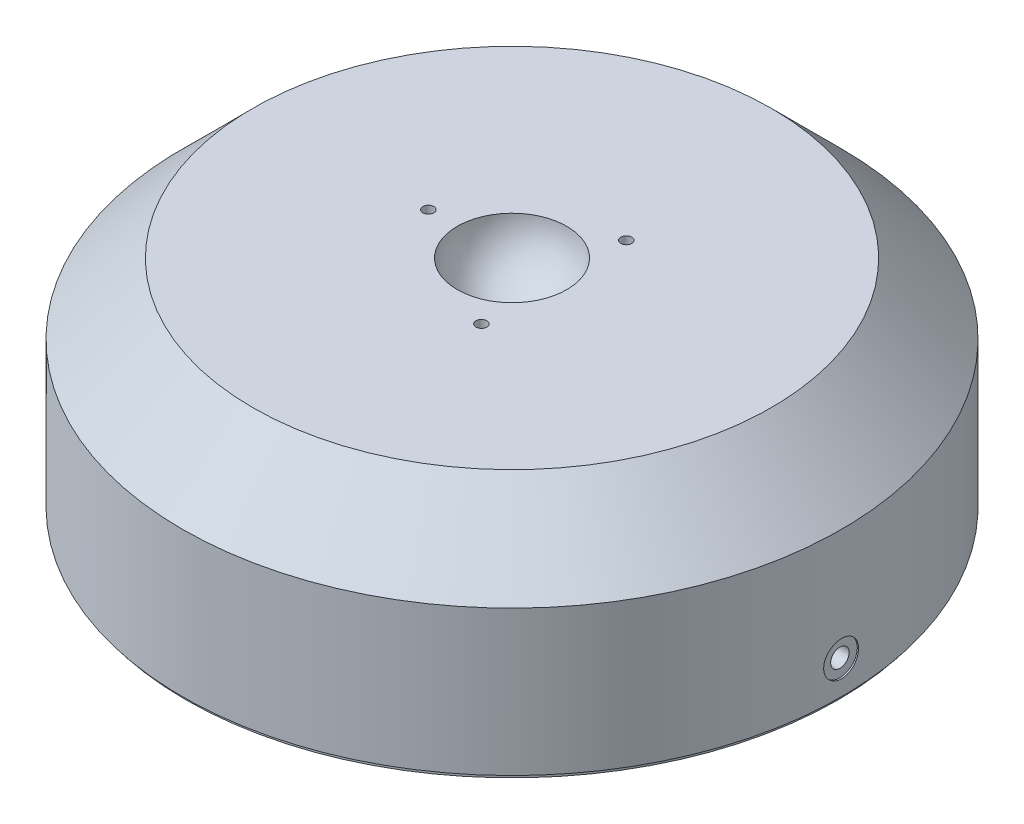
ISO-10303-21;
HEADER;
FILE_DESCRIPTION(('STEP AP214'),'2;1');
FILE_NAME('part.step','',(''),(''),'','','');
FILE_SCHEMA(('AUTOMOTIVE_DESIGN { 1 0 10303 214 1 1 1 1 }'));
ENDSEC;
DATA;
#1=APPLICATION_CONTEXT('core data for automotive mechanical design processes');
#2=APPLICATION_PROTOCOL_DEFINITION('international standard','automotive_design',2000,#1);
#3=PRODUCT_CONTEXT('',#1,'mechanical');
#4=PRODUCT('Part','Part','',(#3));
#5=PRODUCT_RELATED_PRODUCT_CATEGORY('part','',(#4));
#6=PRODUCT_DEFINITION_FORMATION('','',#4);
#7=PRODUCT_DEFINITION_CONTEXT('part definition',#1,'design');
#8=PRODUCT_DEFINITION('design','',#6,#7);
#9=PRODUCT_DEFINITION_SHAPE('','',#8);
#10=(LENGTH_UNIT() NAMED_UNIT(*) SI_UNIT(.MILLI.,.METRE.));
#11=(NAMED_UNIT(*) PLANE_ANGLE_UNIT() SI_UNIT($,.RADIAN.));
#12=(NAMED_UNIT(*) SI_UNIT($,.STERADIAN.) SOLID_ANGLE_UNIT());
#13=UNCERTAINTY_MEASURE_WITH_UNIT(LENGTH_MEASURE(1.E-05),#10,'distance_accuracy_value','');
#14=(GEOMETRIC_REPRESENTATION_CONTEXT(3) GLOBAL_UNCERTAINTY_ASSIGNED_CONTEXT((#13)) GLOBAL_UNIT_ASSIGNED_CONTEXT((#10,
#11,#12)) REPRESENTATION_CONTEXT('',''));
#15=CARTESIAN_POINT('',(0.,0.,0.));
#16=DIRECTION('',(0.,0.,1.));
#17=DIRECTION('',(1.,0.,0.));
#18=AXIS2_PLACEMENT_3D('',#15,#16,#17);
#19=CARTESIAN_POINT('',(0.,0.,0.));
#20=DIRECTION('',(0.,1.,0.));
#21=DIRECTION('',(0.,0.,1.));
#22=AXIS2_PLACEMENT_3D('',#19,#20,#21);
#23=PLANE('',#22);
#24=CARTESIAN_POINT('',(0.,0.,0.));
#25=DIRECTION('',(0.,-1.,0.));
#26=DIRECTION('',(0.,0.,-1.));
#27=AXIS2_PLACEMENT_3D('',#24,#25,#26);
#28=CIRCLE('',#27,75.057);
#29=CARTESIAN_POINT('',(0.,0.,-75.057));
#30=VERTEX_POINT('',#29);
#31=EDGE_CURVE('E120',#30,#30,#28,.T.);
#32=ORIENTED_EDGE('',*,*,#31,.T.);
#33=EDGE_LOOP('',(#32));
#34=FACE_BOUND('',#33,.T.);
#35=CARTESIAN_POINT('',(0.,0.,0.));
#36=DIRECTION('',(0.,1.,0.));
#37=DIRECTION('',(0.,0.,1.));
#38=AXIS2_PLACEMENT_3D('',#35,#36,#37);
#39=CIRCLE('',#38,74.295);
#40=CARTESIAN_POINT('',(0.,0.,74.295));
#41=VERTEX_POINT('',#40);
#42=EDGE_CURVE('E123',#41,#41,#39,.F.);
#43=ORIENTED_EDGE('',*,*,#42,.F.);
#44=EDGE_LOOP('',(#43));
#45=FACE_BOUND('',#44,.T.);
#46=ADVANCED_FACE('F48',(#34,#45),#23,.F.);
#47=CARTESIAN_POINT('',(0.,37.846,0.));
#48=DIRECTION('',(0.,-1.,0.));
#49=DIRECTION('',(0.,0.,-1.));
#50=AXIS2_PLACEMENT_3D('',#47,#48,#49);
#51=CYLINDRICAL_SURFACE('',#50,75.057);
#52=CARTESIAN_POINT('',(74.9519997894486,7.5179,-3.96874999999999));
#53=CARTESIAN_POINT('',(74.9520011987338,7.74065917935636,-3.96874017479041));
#54=CARTESIAN_POINT('',(74.9530035330364,7.96357591314838,-3.94993236207653));
#55=CARTESIAN_POINT('',(74.9569052219996,8.40325866146794,-3.87517168863394));
#56=CARTESIAN_POINT('',(74.9598068060623,8.62001713484051,-3.81917517344818));
#57=CARTESIAN_POINT('',(74.9671774069539,9.04095056729069,-3.67164593114319));
#58=CARTESIAN_POINT('',(74.9716456186698,9.24513192668403,-3.58013145464519));
#59=CARTESIAN_POINT('',(74.9816449833115,9.63518008108793,-3.3641923908251));
#60=CARTESIAN_POINT('',(74.9871758868326,9.82105115791299,-3.2397755228402));
#61=CARTESIAN_POINT('',(74.9986844473067,10.1694648338128,-2.96140950370005));
#62=CARTESIAN_POINT('',(75.0046625360606,10.331984430819,-2.80743157780581));
#63=CARTESIAN_POINT('',(75.0163877990249,10.6288855139053,-2.47437231861881));
#64=CARTESIAN_POINT('',(75.0221349637588,10.7632658461822,-2.29528995646325));
#65=CARTESIAN_POINT('',(75.0327541760092,11.0001388585854,-1.9169827319376));
#66=CARTESIAN_POINT('',(75.0376257242821,11.1026133714393,-1.71774647910281));
#67=CARTESIAN_POINT('',(75.0459403402522,11.2726493396161,-1.30486718510261));
#68=CARTESIAN_POINT('',(75.0493834197017,11.3402110821741,-1.09122426248038));
#69=CARTESIAN_POINT('',(75.0544501995968,11.4384422300209,-0.655810047535728));
#70=CARTESIAN_POINT('',(75.0560756151395,11.4691464150875,-0.434046621939505));
#71=CARTESIAN_POINT('',(75.0573296614885,11.4928982187111,0.0114921814335962));
#72=CARTESIAN_POINT('',(75.0569583094392,11.485946160586,0.235267541919455));
#73=CARTESIAN_POINT('',(75.0542621084729,11.4346116438454,0.678242536761335));
#74=CARTESIAN_POINT('',(75.0519392130319,11.3902666150664,0.897446522239497));
#75=CARTESIAN_POINT('',(75.0456037943922,11.2654629849571,1.32529483488958));
#76=CARTESIAN_POINT('',(75.0415912634938,11.1850042190569,1.53393911393622));
#77=CARTESIAN_POINT('',(75.0323251524314,10.9902144280928,1.93486581624418));
#78=CARTESIAN_POINT('',(75.027070948402,10.8758663683535,2.12713994822586));
#79=CARTESIAN_POINT('',(75.015913114783,10.6165563409207,2.48977779417526));
#80=CARTESIAN_POINT('',(75.0100094800342,10.4715941300176,2.6601413340602));
#81=CARTESIAN_POINT('',(74.9982090032488,10.1549591884809,2.97434033285875));
#82=CARTESIAN_POINT('',(74.9923121783712,9.98325398122557,3.11814306603936));
#83=CARTESIAN_POINT('',(74.9811973694984,9.61812115291935,3.37488626890727));
#84=CARTESIAN_POINT('',(74.9759793857002,9.42469352556579,3.48782672963996));
#85=CARTESIAN_POINT('',(74.9668112523569,9.02158658355943,3.67963667628598));
#86=CARTESIAN_POINT('',(74.9628611497623,8.81190666742821,3.75850490051449));
#87=CARTESIAN_POINT('',(74.9566760035508,8.38225624012756,3.87990958217125));
#88=CARTESIAN_POINT('',(74.9544409455074,8.16228581553492,3.92244634520784));
#89=CARTESIAN_POINT('',(74.9519406134615,7.71858368142653,3.96994010425508));
#90=CARTESIAN_POINT('',(74.951672957871,7.49485684823176,3.97494253662878));
#91=CARTESIAN_POINT('',(74.9531313960317,7.04974202014507,3.947344235402));
#92=CARTESIAN_POINT('',(74.9548574823953,6.82835401658993,3.91474364113565));
#93=CARTESIAN_POINT('',(74.9601066899001,6.39432905017776,3.81290239447483));
#94=CARTESIAN_POINT('',(74.9636287896743,6.18168718770871,3.74368256607566));
#95=CARTESIAN_POINT('',(74.9720721959954,5.77103962944875,3.570588826158));
#96=CARTESIAN_POINT('',(74.9769935116097,5.57303402851564,3.46671469006857));
#97=CARTESIAN_POINT('',(74.9876864832152,5.19707067789185,3.22714443290036));
#98=CARTESIAN_POINT('',(74.9934589523656,5.01913238985565,3.09141780699925));
#99=CARTESIAN_POINT('',(75.0052007805323,4.68855050586233,2.79203988155994));
#100=CARTESIAN_POINT('',(75.0111701409476,4.53590708968276,2.62838838356885));
#101=CARTESIAN_POINT('',(75.0226399370846,4.26009508387298,2.27761094201221));
#102=CARTESIAN_POINT('',(75.028139902228,4.13695585442898,2.09046189542658));
#103=CARTESIAN_POINT('',(75.0380443458102,3.92384844673651,1.69811847870374));
#104=CARTESIAN_POINT('',(75.0424488294381,3.8338801113656,1.49292419404812));
#105=CARTESIAN_POINT('',(75.0496636957527,3.68971964585821,1.07042396343556));
#106=CARTESIAN_POINT('',(75.0524749133548,3.63550877537858,0.853124426657636));
#107=CARTESIAN_POINT('',(75.0561897598977,3.56434072486426,0.412492425065673));
#108=CARTESIAN_POINT('',(75.057093401285,3.54738330176241,0.189159999623978));
#109=CARTESIAN_POINT('',(75.0568913117214,3.55120581083407,-0.256906967790275));
#110=CARTESIAN_POINT('',(75.0557880317332,3.5719397122733,-0.479641906795679));
#111=CARTESIAN_POINT('',(75.0517011108441,3.65046109552251,-0.918463709122978));
#112=CARTESIAN_POINT('',(75.0487174664451,3.70824864626676,-1.13455056007604));
#113=CARTESIAN_POINT('',(75.0412054266142,3.85922729179537,-1.55395124499831));
#114=CARTESIAN_POINT('',(75.0366770237867,3.95241855607924,-1.75726501780945));
#115=CARTESIAN_POINT('',(75.026584568452,4.17155173481772,-2.14536439355045));
#116=CARTESIAN_POINT('',(75.0210205466969,4.29749267683483,-2.33015054639598));
#117=CARTESIAN_POINT('',(75.009475180947,4.57871655479177,-2.67618023399167));
#118=CARTESIAN_POINT('',(75.0034933804072,4.7340319175747,-2.83739739853935));
#119=CARTESIAN_POINT('',(74.9917899016957,5.06956805845578,-3.13152119349439));
#120=CARTESIAN_POINT('',(74.9860682878124,5.24979494787939,-3.26442085662334));
#121=CARTESIAN_POINT('',(74.9755263307122,5.63019336627627,-3.4982070037033));
#122=CARTESIAN_POINT('',(74.9707069113145,5.83038502061472,-3.59906074650147));
#123=CARTESIAN_POINT('',(74.9625272551632,6.24473637240962,-3.76560412250145));
#124=CARTESIAN_POINT('',(74.9591652987888,6.45887926398395,-3.83133521737981));
#125=CARTESIAN_POINT('',(74.9551682699803,6.81494034609652,-3.90855899208089));
#126=CARTESIAN_POINT('',(74.953985344489,6.95455320881458,-3.93110172484573));
#127=CARTESIAN_POINT('',(74.952400657675,7.23538958819313,-3.96120033742646));
#128=CARTESIAN_POINT('',(74.9519988955975,7.3766131032973,-3.9687562317224));
#129=CARTESIAN_POINT('',(74.9519997894486,7.5179,-3.96874999999999));
#130=B_SPLINE_CURVE_WITH_KNOTS('',3,(#52,#53,#54,#55,#56,#57,#58,#59,#60,#61,#62,#63,#64,#65,
#66,#67,#68,#69,#70,#71,#72,#73,#74,#75,#76,#77,#78,#79,#80,#81,#82,#83,#84,#85,#86,#87,#88,#89,
#90,#91,#92,#93,#94,#95,#96,#97,#98,#99,#100,#101,#102,#103,#104,#105,#106,#107,#108,#109,#110,
#111,#112,#113,#114,#115,#116,#117,#118,#119,#120,#121,#122,#123,#124,#125,#126,#127,#128,#129),
.UNSPECIFIED.,.T.,.F.,(4,2,2,2,2,2,2,2,2,2,2,2,2,2,2,2,2,2,2,2,2,2,2,2,2,2,2,2,2,2,2,2,2,2,2,2,
2,2,4),(0.,0.667761779477054,1.33630880885381,2.00451276451516,2.67256008953756,
3.34126101959184,4.00998936323808,4.67909778944455,5.34820071066186,6.0166717508766,
6.6851370515827,7.35293402116437,8.02073403391984,8.68887029169319,9.35701185757654,
10.0259712318936,10.6949308003072,11.3639151379728,12.0328938483063,12.7010626102415,
13.3692288963544,14.0370156289563,14.7048066891132,15.3732399151319,16.0416778916838,
16.7107783065428,17.3798755519955,18.0486218470585,18.7173637787469,19.3852895543313,
20.0532165725226,20.7211467885346,21.389057173932,22.0577092248726,22.7265256024305,
23.3960231252885,24.0647285620611,24.4882625371245,24.9117961029762),.UNSPECIFIED.);
#131=CARTESIAN_POINT('',(74.9519997894486,7.5179,-3.96874999999999));
#132=VERTEX_POINT('',#131);
#133=EDGE_CURVE('E52',#132,#132,#130,.T.);
#134=ORIENTED_EDGE('',*,*,#133,.F.);
#135=EDGE_LOOP('',(#134));
#136=FACE_BOUND('',#135,.T.);
#137=CARTESIAN_POINT('',(0.,33.0195,0.));
#138=DIRECTION('',(0.,1.,0.));
#139=DIRECTION('',(0.,0.,1.));
#140=AXIS2_PLACEMENT_3D('',#137,#138,#139);
#141=CIRCLE('',#140,75.057);
#142=CARTESIAN_POINT('',(0.,33.0195,75.057));
#143=VERTEX_POINT('',#142);
#144=EDGE_CURVE('E61',#143,#143,#141,.F.);
#145=ORIENTED_EDGE('',*,*,#144,.T.);
#146=EDGE_LOOP('',(#145));
#147=FACE_BOUND('',#146,.T.);
#148=ORIENTED_EDGE('',*,*,#31,.F.);
#149=EDGE_LOOP('',(#148));
#150=FACE_BOUND('',#149,.T.);
#151=ADVANCED_FACE('F131',(#136,#147,#150),#51,.T.);
#152=CARTESIAN_POINT('',(0.,-0.9906,0.));
#153=DIRECTION('',(0.,1.,0.));
#154=DIRECTION('',(0.,0.,1.));
#155=AXIS2_PLACEMENT_3D('',#152,#153,#154);
#156=CYLINDRICAL_SURFACE('',#155,74.295);
#157=CARTESIAN_POINT('',(0.,-0.9906,0.));
#158=DIRECTION('',(0.,-1.,0.));
#159=DIRECTION('',(0.,0.,-1.));
#160=AXIS2_PLACEMENT_3D('',#157,#158,#159);
#161=CIRCLE('',#160,74.295);
#162=CARTESIAN_POINT('',(0.,-0.9906,-74.295));
#163=VERTEX_POINT('',#162);
#164=EDGE_CURVE('E117',#163,#163,#161,.T.);
#165=ORIENTED_EDGE('',*,*,#164,.F.);
#166=EDGE_LOOP('',(#165));
#167=FACE_BOUND('',#166,.T.);
#168=ORIENTED_EDGE('',*,*,#42,.T.);
#169=EDGE_LOOP('',(#168));
#170=FACE_BOUND('',#169,.T.);
#171=ADVANCED_FACE('F154',(#167,#170),#156,.T.);
#172=CARTESIAN_POINT('',(0.,-0.9906,0.));
#173=DIRECTION('',(0.,-1.,0.));
#174=DIRECTION('',(0.,0.,-1.));
#175=AXIS2_PLACEMENT_3D('',#172,#173,#174);
#176=PLANE('',#175);
#177=ORIENTED_EDGE('',*,*,#164,.T.);
#178=EDGE_LOOP('',(#177));
#179=FACE_BOUND('',#178,.T.);
#180=ADVANCED_FACE('F161',(#179),#176,.T.);
#181=CARTESIAN_POINT('',(0.,49.0215,0.));
#182=DIRECTION('',(0.,1.,0.));
#183=DIRECTION('',(0.,0.,1.));
#184=AXIS2_PLACEMENT_3D('',#181,#182,#183);
#185=PLANE('',#184);
#186=CARTESIAN_POINT('',(9.52499999999985,49.0215,-16.4977839420937));
#187=DIRECTION('',(0.,1.,0.));
#188=DIRECTION('',(0.,0.,1.));
#189=AXIS2_PLACEMENT_3D('',#186,#187,#188);
#190=CIRCLE('',#189,1.24999999999999);
#191=CARTESIAN_POINT('',(9.52499999999985,49.0215,-15.2477839420937));
#192=VERTEX_POINT('',#191);
#193=EDGE_CURVE('E88',#192,#192,#190,.T.);
#194=ORIENTED_EDGE('',*,*,#193,.F.);
#195=EDGE_LOOP('',(#194));
#196=FACE_BOUND('',#195,.T.);
#197=CARTESIAN_POINT('',(9.52500000000008,49.0215,16.4977839420935));
#198=DIRECTION('',(0.,1.,0.));
#199=DIRECTION('',(0.,0.,1.));
#200=AXIS2_PLACEMENT_3D('',#197,#198,#199);
#201=CIRCLE('',#200,1.24999999999999);
#202=CARTESIAN_POINT('',(9.52500000000008,49.0215,17.7477839420935));
#203=VERTEX_POINT('',#202);
#204=EDGE_CURVE('E98',#203,#203,#201,.T.);
#205=ORIENTED_EDGE('',*,*,#204,.F.);
#206=EDGE_LOOP('',(#205));
#207=FACE_BOUND('',#206,.T.);
#208=CARTESIAN_POINT('',(-19.05,49.0215,0.));
#209=DIRECTION('',(0.,1.,0.));
#210=DIRECTION('',(0.,0.,1.));
#211=AXIS2_PLACEMENT_3D('',#208,#209,#210);
#212=CIRCLE('',#211,1.24999999999999);
#213=CARTESIAN_POINT('',(-19.05,49.0215,1.24999999999999));
#214=VERTEX_POINT('',#213);
#215=EDGE_CURVE('E104',#214,#214,#212,.T.);
#216=ORIENTED_EDGE('',*,*,#215,.F.);
#217=EDGE_LOOP('',(#216));
#218=FACE_BOUND('',#217,.T.);
#219=CARTESIAN_POINT('',(0.,49.0215,0.));
#220=DIRECTION('',(0.,1.,0.));
#221=DIRECTION('',(0.,0.,1.));
#222=AXIS2_PLACEMENT_3D('',#219,#220,#221);
#223=CIRCLE('',#222,59.055);
#224=CARTESIAN_POINT('',(0.,49.0215,59.055));
#225=VERTEX_POINT('',#224);
#226=EDGE_CURVE('E13',#225,#225,#223,.T.);
#227=ORIENTED_EDGE('',*,*,#226,.T.);
#228=EDGE_LOOP('',(#227));
#229=FACE_BOUND('',#228,.T.);
#230=CARTESIAN_POINT('',(0.,49.0215,0.));
#231=DIRECTION('',(0.,1.,0.));
#232=DIRECTION('',(0.,0.,1.));
#233=AXIS2_PLACEMENT_3D('',#230,#231,#232);
#234=CIRCLE('',#233,12.489648153596);
#235=CARTESIAN_POINT('',(0.,49.0215,12.489648153596));
#236=VERTEX_POINT('',#235);
#237=EDGE_CURVE('E110',#236,#236,#234,.T.);
#238=ORIENTED_EDGE('',*,*,#237,.F.);
#239=EDGE_LOOP('',(#238));
#240=FACE_BOUND('',#239,.T.);
#241=ADVANCED_FACE('F165',(#196,#207,#218,#229,#240),#185,.T.);
#242=CARTESIAN_POINT('',(0.,49.5295,0.));
#243=DIRECTION('',(1.,0.,0.));
#244=DIRECTION('',(0.,0.,1.));
#245=AXIS2_PLACEMENT_3D('',#242,#243,#244);
#246=SPHERICAL_SURFACE('',#245,12.499975);
#247=CARTESIAN_POINT('',(0.,49.5295,0.));
#248=DIRECTION('',(0.,1.,0.));
#249=DIRECTION('',(0.,0.,1.));
#250=AXIS2_PLACEMENT_3D('',#247,#248,#249);
#251=SPHERICAL_SURFACE('',#250,12.499975);
#252=ORIENTED_EDGE('',*,*,#237,.T.);
#253=EDGE_LOOP('',(#252));
#254=FACE_BOUND('',#253,.T.);
#255=CARTESIAN_POINT('',(0.,37.2596694697675,0.));
#256=DIRECTION('',(0.,1.,0.));
#257=DIRECTION('',(0.,0.,1.));
#258=AXIS2_PLACEMENT_3D('',#255,#256,#257);
#259=CIRCLE('',#258,2.3876);
#260=CARTESIAN_POINT('',(0.,37.2596694697675,2.3876));
#261=VERTEX_POINT('',#260);
#262=EDGE_CURVE('E114',#261,#261,#259,.T.);
#263=ORIENTED_EDGE('',*,*,#262,.F.);
#264=EDGE_LOOP('',(#263));
#265=FACE_BOUND('',#264,.T.);
#266=ADVANCED_FACE('F168',(#254,#265),#251,.F.);
#267=CARTESIAN_POINT('',(0.,36.5755,0.));
#268=DIRECTION('',(0.,1.,0.));
#269=DIRECTION('',(0.,0.,1.));
#270=AXIS2_PLACEMENT_3D('',#267,#268,#269);
#271=PLANE('',#270);
#272=CARTESIAN_POINT('',(0.,36.5755,0.));
#273=DIRECTION('',(0.,1.,0.));
#274=DIRECTION('',(0.,0.,1.));
#275=AXIS2_PLACEMENT_3D('',#272,#273,#274);
#276=CIRCLE('',#275,2.3876);
#277=CARTESIAN_POINT('',(0.,36.5755,2.3876));
#278=VERTEX_POINT('',#277);
#279=EDGE_CURVE('E113',#278,#278,#276,.T.);
#280=ORIENTED_EDGE('',*,*,#279,.T.);
#281=EDGE_LOOP('',(#280));
#282=FACE_BOUND('',#281,.T.);
#283=ADVANCED_FACE('F145',(#282),#271,.T.);
#284=CARTESIAN_POINT('',(0.,36.5755,0.));
#285=DIRECTION('',(0.,1.,0.));
#286=DIRECTION('',(0.,0.,1.));
#287=AXIS2_PLACEMENT_3D('',#284,#285,#286);
#288=CYLINDRICAL_SURFACE('',#287,2.3876);
#289=ORIENTED_EDGE('',*,*,#262,.T.);
#290=EDGE_LOOP('',(#289));
#291=FACE_BOUND('',#290,.T.);
#292=ORIENTED_EDGE('',*,*,#279,.F.);
#293=EDGE_LOOP('',(#292));
#294=FACE_BOUND('',#293,.T.);
#295=ADVANCED_FACE('F136',(#291,#294),#288,.F.);
#296=CARTESIAN_POINT('',(0.,33.0195,0.));
#297=DIRECTION('',(0.,-1.,0.));
#298=DIRECTION('',(0.,0.,-1.));
#299=AXIS2_PLACEMENT_3D('',#296,#297,#298);
#300=CONICAL_SURFACE('',#299,75.057,0.78539816339745);
#301=ORIENTED_EDGE('',*,*,#226,.F.);
#302=EDGE_LOOP('',(#301));
#303=FACE_BOUND('',#302,.T.);
#304=ORIENTED_EDGE('',*,*,#144,.F.);
#305=EDGE_LOOP('',(#304));
#306=FACE_BOUND('',#305,.T.);
#307=ADVANCED_FACE('F50',(#303,#306),#300,.T.);
#308=CARTESIAN_POINT('',(74.676,7.5179,0.));
#309=DIRECTION('',(-1.,0.,0.));
#310=DIRECTION('',(0.,0.,1.));
#311=AXIS2_PLACEMENT_3D('',#308,#309,#310);
#312=PLANE('',#311);
#313=CARTESIAN_POINT('',(74.676,7.5179,0.));
#314=DIRECTION('',(1.,0.,0.));
#315=DIRECTION('',(0.,0.,-1.));
#316=AXIS2_PLACEMENT_3D('',#313,#314,#315);
#317=CIRCLE('',#316,2.09999999999999);
#318=CARTESIAN_POINT('',(74.676,7.5179,-2.09999999999999));
#319=VERTEX_POINT('',#318);
#320=EDGE_CURVE('E85',#319,#319,#317,.T.);
#321=ORIENTED_EDGE('',*,*,#320,.F.);
#322=EDGE_LOOP('',(#321));
#323=FACE_BOUND('',#322,.T.);
#324=CARTESIAN_POINT('',(74.676,7.5179,0.));
#325=DIRECTION('',(1.,0.,0.));
#326=DIRECTION('',(0.,0.,-1.));
#327=AXIS2_PLACEMENT_3D('',#324,#325,#326);
#328=CIRCLE('',#327,3.96874999999999);
#329=CARTESIAN_POINT('',(74.676,7.5179,-3.96874999999999));
#330=VERTEX_POINT('',#329);
#331=EDGE_CURVE('E107',#330,#330,#328,.T.);
#332=ORIENTED_EDGE('',*,*,#331,.T.);
#333=EDGE_LOOP('',(#332));
#334=FACE_BOUND('',#333,.T.);
#335=ADVANCED_FACE('F135',(#323,#334),#312,.F.);
#336=CARTESIAN_POINT('',(75.184,7.5179,0.));
#337=DIRECTION('',(1.,0.,0.));
#338=DIRECTION('',(0.,0.,-1.));
#339=AXIS2_PLACEMENT_3D('',#336,#337,#338);
#340=CYLINDRICAL_SURFACE('',#339,3.96874999999999);
#341=ORIENTED_EDGE('',*,*,#133,.T.);
#342=EDGE_LOOP('',(#341));
#343=FACE_BOUND('',#342,.T.);
#344=ORIENTED_EDGE('',*,*,#331,.F.);
#345=EDGE_LOOP('',(#344));
#346=FACE_BOUND('',#345,.T.);
#347=ADVANCED_FACE('F142',(#343,#346),#340,.F.);
#348=CARTESIAN_POINT('',(-19.05,49.0215,0.));
#349=DIRECTION('',(0.,1.,0.));
#350=DIRECTION('',(0.,0.,1.));
#351=AXIS2_PLACEMENT_3D('',#348,#349,#350);
#352=CYLINDRICAL_SURFACE('',#351,1.24999999999999);
#353=CARTESIAN_POINT('',(-19.05,41.1729,0.));
#354=DIRECTION('',(0.,1.,0.));
#355=DIRECTION('',(0.,0.,1.));
#356=AXIS2_PLACEMENT_3D('',#353,#354,#355);
#357=CIRCLE('',#356,1.24999999999999);
#358=CARTESIAN_POINT('',(-19.05,41.1729,1.24999999999999));
#359=VERTEX_POINT('',#358);
#360=EDGE_CURVE('E101',#359,#359,#357,.T.);
#361=ORIENTED_EDGE('',*,*,#360,.F.);
#362=EDGE_LOOP('',(#361));
#363=FACE_BOUND('',#362,.T.);
#364=ORIENTED_EDGE('',*,*,#215,.T.);
#365=EDGE_LOOP('',(#364));
#366=FACE_BOUND('',#365,.T.);
#367=ADVANCED_FACE('F179',(#363,#366),#352,.F.);
#368=CARTESIAN_POINT('',(-19.05,41.1729,0.));
#369=DIRECTION('',(0.,1.,0.));
#370=DIRECTION('',(0.,0.,1.));
#371=AXIS2_PLACEMENT_3D('',#368,#369,#370);
#372=CONICAL_SURFACE('',#371,1.24999999999999,1.02974425867665);
#373=CARTESIAN_POINT('',(-19.05,40.4218242262155,0.));
#374=VERTEX_POINT('',#373);
#375=VERTEX_LOOP('',#374);
#376=FACE_BOUND('',#375,.T.);
#377=ORIENTED_EDGE('',*,*,#360,.T.);
#378=EDGE_LOOP('',(#377));
#379=FACE_BOUND('',#378,.T.);
#380=ADVANCED_FACE('F183',(#376,#379),#372,.F.);
#381=CARTESIAN_POINT('',(9.52500000000008,49.0215,16.4977839420935));
#382=DIRECTION('',(0.,1.,0.));
#383=DIRECTION('',(0.,0.,1.));
#384=AXIS2_PLACEMENT_3D('',#381,#382,#383);
#385=CYLINDRICAL_SURFACE('',#384,1.24999999999999);
#386=CARTESIAN_POINT('',(9.52500000000008,41.1729,16.4977839420935));
#387=DIRECTION('',(0.,1.,0.));
#388=DIRECTION('',(0.,0.,1.));
#389=AXIS2_PLACEMENT_3D('',#386,#387,#388);
#390=CIRCLE('',#389,1.24999999999999);
#391=CARTESIAN_POINT('',(9.52500000000008,41.1729,17.7477839420935));
#392=VERTEX_POINT('',#391);
#393=EDGE_CURVE('E95',#392,#392,#390,.T.);
#394=ORIENTED_EDGE('',*,*,#393,.F.);
#395=EDGE_LOOP('',(#394));
#396=FACE_BOUND('',#395,.T.);
#397=ORIENTED_EDGE('',*,*,#204,.T.);
#398=EDGE_LOOP('',(#397));
#399=FACE_BOUND('',#398,.T.);
#400=ADVANCED_FACE('F187',(#396,#399),#385,.F.);
#401=CARTESIAN_POINT('',(9.52500000000008,41.1729,16.4977839420935));
#402=DIRECTION('',(0.,1.,0.));
#403=DIRECTION('',(0.,0.,1.));
#404=AXIS2_PLACEMENT_3D('',#401,#402,#403);
#405=CONICAL_SURFACE('',#404,1.24999999999999,1.02974425867665);
#406=CARTESIAN_POINT('',(9.52500000000008,40.4218242262155,16.4977839420935));
#407=VERTEX_POINT('',#406);
#408=VERTEX_LOOP('',#407);
#409=FACE_BOUND('',#408,.T.);
#410=ORIENTED_EDGE('',*,*,#393,.T.);
#411=EDGE_LOOP('',(#410));
#412=FACE_BOUND('',#411,.T.);
#413=ADVANCED_FACE('F190',(#409,#412),#405,.F.);
#414=CARTESIAN_POINT('',(9.52499999999985,49.0215,-16.4977839420937));
#415=DIRECTION('',(0.,1.,0.));
#416=DIRECTION('',(0.,0.,1.));
#417=AXIS2_PLACEMENT_3D('',#414,#415,#416);
#418=CYLINDRICAL_SURFACE('',#417,1.24999999999999);
#419=CARTESIAN_POINT('',(9.52499999999985,41.1729,-16.4977839420937));
#420=DIRECTION('',(0.,1.,0.));
#421=DIRECTION('',(0.,0.,1.));
#422=AXIS2_PLACEMENT_3D('',#419,#420,#421);
#423=CIRCLE('',#422,1.24999999999999);
#424=CARTESIAN_POINT('',(9.52499999999985,41.1729,-15.2477839420937));
#425=VERTEX_POINT('',#424);
#426=EDGE_CURVE('E84',#425,#425,#423,.T.);
#427=ORIENTED_EDGE('',*,*,#426,.F.);
#428=EDGE_LOOP('',(#427));
#429=FACE_BOUND('',#428,.T.);
#430=ORIENTED_EDGE('',*,*,#193,.T.);
#431=EDGE_LOOP('',(#430));
#432=FACE_BOUND('',#431,.T.);
#433=ADVANCED_FACE('F194',(#429,#432),#418,.F.);
#434=CARTESIAN_POINT('',(9.52499999999985,41.1729,-16.4977839420937));
#435=DIRECTION('',(0.,1.,0.));
#436=DIRECTION('',(0.,0.,1.));
#437=AXIS2_PLACEMENT_3D('',#434,#435,#436);
#438=CONICAL_SURFACE('',#437,1.24999999999999,1.02974425867665);
#439=CARTESIAN_POINT('',(9.52499999999985,40.4218242262155,-16.4977839420937));
#440=VERTEX_POINT('',#439);
#441=VERTEX_LOOP('',#440);
#442=FACE_BOUND('',#441,.T.);
#443=ORIENTED_EDGE('',*,*,#426,.T.);
#444=EDGE_LOOP('',(#443));
#445=FACE_BOUND('',#444,.T.);
#446=ADVANCED_FACE('F78',(#442,#445),#438,.F.);
#447=CARTESIAN_POINT('',(8.00100000000001,7.5179,0.));
#448=DIRECTION('',(1.,0.,0.));
#449=DIRECTION('',(0.,0.,-1.));
#450=AXIS2_PLACEMENT_3D('',#447,#448,#449);
#451=CONICAL_SURFACE('',#450,2.09999999999998,1.02974425867665);
#452=CARTESIAN_POINT('',(6.73919270004213,7.51789999999999,0.));
#453=VERTEX_POINT('',#452);
#454=VERTEX_LOOP('',#453);
#455=FACE_BOUND('',#454,.T.);
#456=CARTESIAN_POINT('',(8.00100000000001,7.5179,0.));
#457=DIRECTION('',(1.,0.,0.));
#458=DIRECTION('',(0.,0.,-1.));
#459=AXIS2_PLACEMENT_3D('',#456,#457,#458);
#460=CIRCLE('',#459,2.09999999999998);
#461=CARTESIAN_POINT('',(8.00100000000001,7.5179,-2.09999999999998));
#462=VERTEX_POINT('',#461);
#463=EDGE_CURVE('E82',#462,#462,#460,.T.);
#464=ORIENTED_EDGE('',*,*,#463,.T.);
#465=EDGE_LOOP('',(#464));
#466=FACE_BOUND('',#465,.T.);
#467=ADVANCED_FACE('F74',(#455,#466),#451,.F.);
#468=CARTESIAN_POINT('',(74.676,7.5179,0.));
#469=DIRECTION('',(1.,0.,0.));
#470=DIRECTION('',(0.,0.,-1.));
#471=AXIS2_PLACEMENT_3D('',#468,#469,#470);
#472=CYLINDRICAL_SURFACE('',#471,2.09999999999998);
#473=ORIENTED_EDGE('',*,*,#463,.F.);
#474=EDGE_LOOP('',(#473));
#475=FACE_BOUND('',#474,.T.);
#476=ORIENTED_EDGE('',*,*,#320,.T.);
#477=EDGE_LOOP('',(#476));
#478=FACE_BOUND('',#477,.T.);
#479=ADVANCED_FACE('F77',(#475,#478),#472,.F.);
#480=CLOSED_SHELL('',(#46,#151,#171,#180,#241,#266,#283,#295,#307,#335,#347,#367,#380,#400,#413,
#433,#446,#467,#479));
#481=MANIFOLD_SOLID_BREP('B2',#480);
#482=ADVANCED_BREP_SHAPE_REPRESENTATION('',(#18,#481),#14);
#483=SHAPE_DEFINITION_REPRESENTATION(#9,#482);
ENDSEC;
END-ISO-10303-21;
